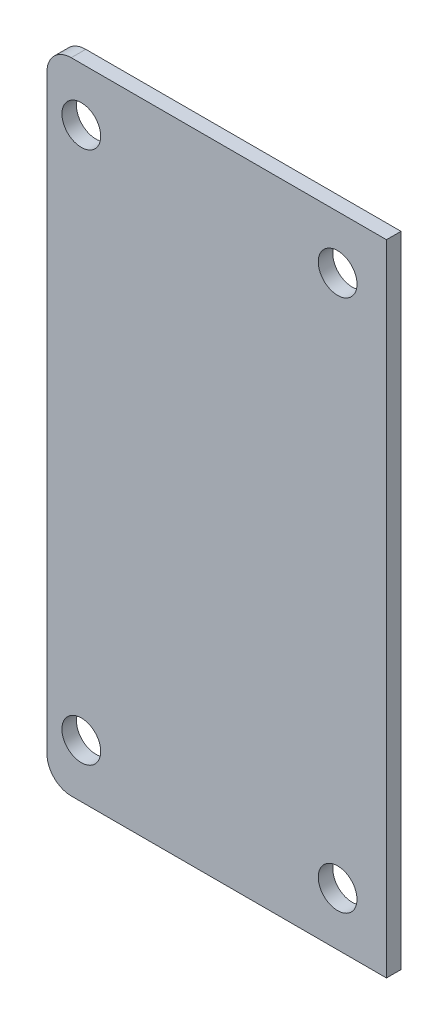
ISO-10303-21;
HEADER;
FILE_DESCRIPTION(('STEP AP214'),'2;1');
FILE_NAME('part.step','',(''),(''),'','','');
FILE_SCHEMA(('AUTOMOTIVE_DESIGN { 1 0 10303 214 1 1 1 1 }'));
ENDSEC;
DATA;
#1=APPLICATION_CONTEXT('core data for automotive mechanical design processes');
#2=APPLICATION_PROTOCOL_DEFINITION('international standard','automotive_design',2000,#1);
#3=PRODUCT_CONTEXT('',#1,'mechanical');
#4=PRODUCT('Part','Part','',(#3));
#5=PRODUCT_RELATED_PRODUCT_CATEGORY('part','',(#4));
#6=PRODUCT_DEFINITION_FORMATION('','',#4);
#7=PRODUCT_DEFINITION_CONTEXT('part definition',#1,'design');
#8=PRODUCT_DEFINITION('design','',#6,#7);
#9=PRODUCT_DEFINITION_SHAPE('','',#8);
#10=(LENGTH_UNIT() NAMED_UNIT(*) SI_UNIT(.MILLI.,.METRE.));
#11=(NAMED_UNIT(*) PLANE_ANGLE_UNIT() SI_UNIT($,.RADIAN.));
#12=(NAMED_UNIT(*) SI_UNIT($,.STERADIAN.) SOLID_ANGLE_UNIT());
#13=UNCERTAINTY_MEASURE_WITH_UNIT(LENGTH_MEASURE(1.E-05),#10,'distance_accuracy_value','');
#14=(GEOMETRIC_REPRESENTATION_CONTEXT(3) GLOBAL_UNCERTAINTY_ASSIGNED_CONTEXT((#13)) GLOBAL_UNIT_ASSIGNED_CONTEXT((#10,
#11,#12)) REPRESENTATION_CONTEXT('',''));
#15=CARTESIAN_POINT('',(0.,0.,0.));
#16=DIRECTION('',(0.,0.,1.));
#17=DIRECTION('',(1.,0.,0.));
#18=AXIS2_PLACEMENT_3D('',#15,#16,#17);
#19=CARTESIAN_POINT('',(-30.042,61.,3.));
#20=DIRECTION('',(0.,0.,1.));
#21=DIRECTION('',(1.,0.,0.));
#22=AXIS2_PLACEMENT_3D('',#19,#20,#21);
#23=PLANE('',#22);
#24=CARTESIAN_POINT('',(-27.958,-55.,3.));
#25=DIRECTION('',(0.,0.,1.));
#26=DIRECTION('',(1.,0.,0.));
#27=AXIS2_PLACEMENT_3D('',#24,#25,#26);
#28=CIRCLE('',#27,4.00000000000001);
#29=CARTESIAN_POINT('',(-23.958,-55.,3.));
#30=VERTEX_POINT('',#29);
#31=EDGE_CURVE('E189',#30,#30,#28,.T.);
#32=ORIENTED_EDGE('',*,*,#31,.F.);
#33=EDGE_LOOP('',(#32));
#34=FACE_BOUND('',#33,.T.);
#35=CARTESIAN_POINT('',(24.958,55.,3.));
#36=DIRECTION('',(0.,0.,1.));
#37=DIRECTION('',(1.,0.,0.));
#38=AXIS2_PLACEMENT_3D('',#35,#36,#37);
#39=CIRCLE('',#38,4.00000000000001);
#40=CARTESIAN_POINT('',(28.958,55.,3.));
#41=VERTEX_POINT('',#40);
#42=EDGE_CURVE('E122',#41,#41,#39,.T.);
#43=ORIENTED_EDGE('',*,*,#42,.F.);
#44=EDGE_LOOP('',(#43));
#45=FACE_BOUND('',#44,.T.);
#46=CARTESIAN_POINT('',(-30.042,61.,3.));
#47=DIRECTION('',(0.,0.,1.));
#48=DIRECTION('',(1.,0.,0.));
#49=AXIS2_PLACEMENT_3D('',#46,#47,#48);
#50=CIRCLE('',#49,5.);
#51=CARTESIAN_POINT('',(-30.042,66.,3.));
#52=VERTEX_POINT('',#51);
#53=CARTESIAN_POINT('',(-35.042,61.,3.));
#54=VERTEX_POINT('',#53);
#55=EDGE_CURVE('E129',#52,#54,#50,.T.);
#56=ORIENTED_EDGE('',*,*,#55,.T.);
#57=DIRECTION('',(0.,-1.,0.));
#58=VECTOR('',#57,1.);
#59=CARTESIAN_POINT('',(-35.042,61.,3.));
#60=LINE('',#59,#58);
#61=CARTESIAN_POINT('',(-35.042,-61.,3.));
#62=VERTEX_POINT('',#61);
#63=EDGE_CURVE('E87',#54,#62,#60,.T.);
#64=ORIENTED_EDGE('',*,*,#63,.T.);
#65=CARTESIAN_POINT('',(-30.042,-61.,3.));
#66=DIRECTION('',(0.,0.,1.));
#67=DIRECTION('',(1.,0.,0.));
#68=AXIS2_PLACEMENT_3D('',#65,#66,#67);
#69=CIRCLE('',#68,5.);
#70=CARTESIAN_POINT('',(-30.042,-66.,3.));
#71=VERTEX_POINT('',#70);
#72=EDGE_CURVE('E100',#62,#71,#69,.T.);
#73=ORIENTED_EDGE('',*,*,#72,.T.);
#74=DIRECTION('',(1.,0.,0.));
#75=VECTOR('',#74,1.);
#76=CARTESIAN_POINT('',(-30.042,-66.,3.));
#77=LINE('',#76,#75);
#78=CARTESIAN_POINT('',(35.042,-66.,3.));
#79=VERTEX_POINT('',#78);
#80=EDGE_CURVE('E94',#71,#79,#77,.T.);
#81=ORIENTED_EDGE('',*,*,#80,.T.);
#82=DIRECTION('',(0.,1.,0.));
#83=VECTOR('',#82,1.);
#84=CARTESIAN_POINT('',(35.042,-66.,3.));
#85=LINE('',#84,#83);
#86=CARTESIAN_POINT('',(35.042,66.,3.));
#87=VERTEX_POINT('',#86);
#88=EDGE_CURVE('E98',#79,#87,#85,.T.);
#89=ORIENTED_EDGE('',*,*,#88,.T.);
#90=DIRECTION('',(-1.,0.,0.));
#91=VECTOR('',#90,1.);
#92=CARTESIAN_POINT('',(35.042,66.,3.));
#93=LINE('',#92,#91);
#94=EDGE_CURVE('E50',#87,#52,#93,.T.);
#95=ORIENTED_EDGE('',*,*,#94,.T.);
#96=EDGE_LOOP('',(#56,#64,#73,#81,#89,#95));
#97=FACE_BOUND('',#96,.T.);
#98=CARTESIAN_POINT('',(-27.958,55.,3.));
#99=DIRECTION('',(0.,0.,1.));
#100=DIRECTION('',(1.,0.,0.));
#101=AXIS2_PLACEMENT_3D('',#98,#99,#100);
#102=CIRCLE('',#101,4.00000000000001);
#103=CARTESIAN_POINT('',(-23.958,55.,3.));
#104=VERTEX_POINT('',#103);
#105=EDGE_CURVE('E195',#104,#104,#102,.T.);
#106=ORIENTED_EDGE('',*,*,#105,.F.);
#107=EDGE_LOOP('',(#106));
#108=FACE_BOUND('',#107,.T.);
#109=CARTESIAN_POINT('',(24.958,-55.,3.));
#110=DIRECTION('',(0.,0.,1.));
#111=DIRECTION('',(1.,0.,0.));
#112=AXIS2_PLACEMENT_3D('',#109,#110,#111);
#113=CIRCLE('',#112,4.00000000000001);
#114=CARTESIAN_POINT('',(28.958,-55.,3.));
#115=VERTEX_POINT('',#114);
#116=EDGE_CURVE('E180',#115,#115,#113,.T.);
#117=ORIENTED_EDGE('',*,*,#116,.F.);
#118=EDGE_LOOP('',(#117));
#119=FACE_BOUND('',#118,.T.);
#120=ADVANCED_FACE('F33',(#34,#45,#97,#108,#119),#23,.T.);
#121=CARTESIAN_POINT('',(-30.042,61.,0.));
#122=DIRECTION('',(0.,0.,1.));
#123=DIRECTION('',(1.,0.,0.));
#124=AXIS2_PLACEMENT_3D('',#121,#122,#123);
#125=PLANE('',#124);
#126=CARTESIAN_POINT('',(-30.042,61.,0.));
#127=DIRECTION('',(0.,0.,1.));
#128=DIRECTION('',(1.,0.,0.));
#129=AXIS2_PLACEMENT_3D('',#126,#127,#128);
#130=CIRCLE('',#129,5.);
#131=CARTESIAN_POINT('',(-30.042,66.,0.));
#132=VERTEX_POINT('',#131);
#133=CARTESIAN_POINT('',(-35.042,61.,0.));
#134=VERTEX_POINT('',#133);
#135=EDGE_CURVE('E118',#132,#134,#130,.T.);
#136=ORIENTED_EDGE('',*,*,#135,.F.);
#137=DIRECTION('',(-1.,0.,0.));
#138=VECTOR('',#137,1.);
#139=CARTESIAN_POINT('',(35.042,66.,0.));
#140=LINE('',#139,#138);
#141=CARTESIAN_POINT('',(35.042,66.,0.));
#142=VERTEX_POINT('',#141);
#143=EDGE_CURVE('E79',#142,#132,#140,.T.);
#144=ORIENTED_EDGE('',*,*,#143,.F.);
#145=DIRECTION('',(0.,1.,0.));
#146=VECTOR('',#145,1.);
#147=CARTESIAN_POINT('',(35.042,-66.,0.));
#148=LINE('',#147,#146);
#149=CARTESIAN_POINT('',(35.042,-66.,0.));
#150=VERTEX_POINT('',#149);
#151=EDGE_CURVE('E73',#150,#142,#148,.T.);
#152=ORIENTED_EDGE('',*,*,#151,.F.);
#153=DIRECTION('',(1.,0.,0.));
#154=VECTOR('',#153,1.);
#155=CARTESIAN_POINT('',(-30.042,-66.,0.));
#156=LINE('',#155,#154);
#157=CARTESIAN_POINT('',(-30.042,-66.,0.));
#158=VERTEX_POINT('',#157);
#159=EDGE_CURVE('E108',#158,#150,#156,.T.);
#160=ORIENTED_EDGE('',*,*,#159,.F.);
#161=CARTESIAN_POINT('',(-30.042,-61.,0.));
#162=DIRECTION('',(0.,0.,1.));
#163=DIRECTION('',(1.,0.,0.));
#164=AXIS2_PLACEMENT_3D('',#161,#162,#163);
#165=CIRCLE('',#164,5.);
#166=CARTESIAN_POINT('',(-35.042,-61.,0.));
#167=VERTEX_POINT('',#166);
#168=EDGE_CURVE('E124',#167,#158,#165,.T.);
#169=ORIENTED_EDGE('',*,*,#168,.F.);
#170=DIRECTION('',(0.,-1.,0.));
#171=VECTOR('',#170,1.);
#172=CARTESIAN_POINT('',(-35.042,61.,0.));
#173=LINE('',#172,#171);
#174=EDGE_CURVE('E121',#134,#167,#173,.T.);
#175=ORIENTED_EDGE('',*,*,#174,.F.);
#176=EDGE_LOOP('',(#136,#144,#152,#160,#169,#175));
#177=FACE_BOUND('',#176,.T.);
#178=CARTESIAN_POINT('',(24.958,55.,0.));
#179=DIRECTION('',(0.,0.,1.));
#180=DIRECTION('',(1.,0.,0.));
#181=AXIS2_PLACEMENT_3D('',#178,#179,#180);
#182=CIRCLE('',#181,4.00000000000001);
#183=CARTESIAN_POINT('',(28.958,55.,0.));
#184=VERTEX_POINT('',#183);
#185=EDGE_CURVE('E198',#184,#184,#182,.T.);
#186=ORIENTED_EDGE('',*,*,#185,.T.);
#187=EDGE_LOOP('',(#186));
#188=FACE_BOUND('',#187,.T.);
#189=CARTESIAN_POINT('',(-27.958,55.,0.));
#190=DIRECTION('',(0.,0.,1.));
#191=DIRECTION('',(1.,0.,0.));
#192=AXIS2_PLACEMENT_3D('',#189,#190,#191);
#193=CIRCLE('',#192,4.00000000000001);
#194=CARTESIAN_POINT('',(-23.958,55.,0.));
#195=VERTEX_POINT('',#194);
#196=EDGE_CURVE('E192',#195,#195,#193,.T.);
#197=ORIENTED_EDGE('',*,*,#196,.T.);
#198=EDGE_LOOP('',(#197));
#199=FACE_BOUND('',#198,.T.);
#200=CARTESIAN_POINT('',(-27.958,-55.,0.));
#201=DIRECTION('',(0.,0.,1.));
#202=DIRECTION('',(1.,0.,0.));
#203=AXIS2_PLACEMENT_3D('',#200,#201,#202);
#204=CIRCLE('',#203,4.00000000000001);
#205=CARTESIAN_POINT('',(-23.958,-55.,0.));
#206=VERTEX_POINT('',#205);
#207=EDGE_CURVE('E186',#206,#206,#204,.T.);
#208=ORIENTED_EDGE('',*,*,#207,.T.);
#209=EDGE_LOOP('',(#208));
#210=FACE_BOUND('',#209,.T.);
#211=CARTESIAN_POINT('',(24.958,-55.,0.));
#212=DIRECTION('',(0.,0.,1.));
#213=DIRECTION('',(1.,0.,0.));
#214=AXIS2_PLACEMENT_3D('',#211,#212,#213);
#215=CIRCLE('',#214,4.00000000000001);
#216=CARTESIAN_POINT('',(28.958,-55.,0.));
#217=VERTEX_POINT('',#216);
#218=EDGE_CURVE('E183',#217,#217,#215,.T.);
#219=ORIENTED_EDGE('',*,*,#218,.T.);
#220=EDGE_LOOP('',(#219));
#221=FACE_BOUND('',#220,.T.);
#222=ADVANCED_FACE('F138',(#177,#188,#199,#210,#221),#125,.F.);
#223=CARTESIAN_POINT('',(-30.042,61.,3.));
#224=DIRECTION('',(0.,0.,-1.));
#225=DIRECTION('',(-1.,0.,0.));
#226=AXIS2_PLACEMENT_3D('',#223,#224,#225);
#227=CYLINDRICAL_SURFACE('',#226,5.);
#228=ORIENTED_EDGE('',*,*,#135,.T.);
#229=DIRECTION('',(0.,0.,-1.));
#230=VECTOR('',#229,1.);
#231=CARTESIAN_POINT('',(-35.042,61.,3.));
#232=LINE('',#231,#230);
#233=EDGE_CURVE('E11',#54,#134,#232,.T.);
#234=ORIENTED_EDGE('',*,*,#233,.F.);
#235=ORIENTED_EDGE('',*,*,#55,.F.);
#236=DIRECTION('',(0.,0.,-1.));
#237=VECTOR('',#236,1.);
#238=CARTESIAN_POINT('',(-30.042,66.,3.));
#239=LINE('',#238,#237);
#240=EDGE_CURVE('E114',#52,#132,#239,.T.);
#241=ORIENTED_EDGE('',*,*,#240,.T.);
#242=EDGE_LOOP('',(#228,#234,#235,#241));
#243=FACE_BOUND('',#242,.T.);
#244=ADVANCED_FACE('F35',(#243),#227,.T.);
#245=CARTESIAN_POINT('',(-35.042,61.,3.));
#246=DIRECTION('',(1.,0.,0.));
#247=DIRECTION('',(0.,0.,-1.));
#248=AXIS2_PLACEMENT_3D('',#245,#246,#247);
#249=PLANE('',#248);
#250=ORIENTED_EDGE('',*,*,#174,.T.);
#251=DIRECTION('',(0.,0.,-1.));
#252=VECTOR('',#251,1.);
#253=CARTESIAN_POINT('',(-35.042,-61.,3.));
#254=LINE('',#253,#252);
#255=EDGE_CURVE('E42',#62,#167,#254,.T.);
#256=ORIENTED_EDGE('',*,*,#255,.F.);
#257=ORIENTED_EDGE('',*,*,#63,.F.);
#258=ORIENTED_EDGE('',*,*,#233,.T.);
#259=EDGE_LOOP('',(#250,#256,#257,#258));
#260=FACE_BOUND('',#259,.T.);
#261=ADVANCED_FACE('F256',(#260),#249,.F.);
#262=CARTESIAN_POINT('',(-30.042,-61.,3.));
#263=DIRECTION('',(0.,0.,-1.));
#264=DIRECTION('',(-1.,0.,0.));
#265=AXIS2_PLACEMENT_3D('',#262,#263,#264);
#266=CYLINDRICAL_SURFACE('',#265,5.);
#267=ORIENTED_EDGE('',*,*,#168,.T.);
#268=DIRECTION('',(0.,0.,-1.));
#269=VECTOR('',#268,1.);
#270=CARTESIAN_POINT('',(-30.042,-66.,3.));
#271=LINE('',#270,#269);
#272=EDGE_CURVE('E109',#71,#158,#271,.T.);
#273=ORIENTED_EDGE('',*,*,#272,.F.);
#274=ORIENTED_EDGE('',*,*,#72,.F.);
#275=ORIENTED_EDGE('',*,*,#255,.T.);
#276=EDGE_LOOP('',(#267,#273,#274,#275));
#277=FACE_BOUND('',#276,.T.);
#278=ADVANCED_FACE('F135',(#277),#266,.T.);
#279=CARTESIAN_POINT('',(-30.042,-66.,3.));
#280=DIRECTION('',(0.,1.,0.));
#281=DIRECTION('',(0.,0.,1.));
#282=AXIS2_PLACEMENT_3D('',#279,#280,#281);
#283=PLANE('',#282);
#284=ORIENTED_EDGE('',*,*,#159,.T.);
#285=DIRECTION('',(0.,0.,-1.));
#286=VECTOR('',#285,1.);
#287=CARTESIAN_POINT('',(35.042,-66.,3.));
#288=LINE('',#287,#286);
#289=EDGE_CURVE('E105',#79,#150,#288,.T.);
#290=ORIENTED_EDGE('',*,*,#289,.F.);
#291=ORIENTED_EDGE('',*,*,#80,.F.);
#292=ORIENTED_EDGE('',*,*,#272,.T.);
#293=EDGE_LOOP('',(#284,#290,#291,#292));
#294=FACE_BOUND('',#293,.T.);
#295=ADVANCED_FACE('F106',(#294),#283,.F.);
#296=CARTESIAN_POINT('',(35.042,-66.,3.));
#297=DIRECTION('',(-1.,0.,0.));
#298=DIRECTION('',(0.,0.,1.));
#299=AXIS2_PLACEMENT_3D('',#296,#297,#298);
#300=PLANE('',#299);
#301=ORIENTED_EDGE('',*,*,#151,.T.);
#302=DIRECTION('',(0.,0.,-1.));
#303=VECTOR('',#302,1.);
#304=CARTESIAN_POINT('',(35.042,66.,3.));
#305=LINE('',#304,#303);
#306=EDGE_CURVE('E110',#87,#142,#305,.T.);
#307=ORIENTED_EDGE('',*,*,#306,.F.);
#308=ORIENTED_EDGE('',*,*,#88,.F.);
#309=ORIENTED_EDGE('',*,*,#289,.T.);
#310=EDGE_LOOP('',(#301,#307,#308,#309));
#311=FACE_BOUND('',#310,.T.);
#312=ADVANCED_FACE('F112',(#311),#300,.F.);
#313=CARTESIAN_POINT('',(35.042,66.,3.));
#314=DIRECTION('',(0.,-1.,0.));
#315=DIRECTION('',(0.,0.,-1.));
#316=AXIS2_PLACEMENT_3D('',#313,#314,#315);
#317=PLANE('',#316);
#318=ORIENTED_EDGE('',*,*,#143,.T.);
#319=ORIENTED_EDGE('',*,*,#240,.F.);
#320=ORIENTED_EDGE('',*,*,#94,.F.);
#321=ORIENTED_EDGE('',*,*,#306,.T.);
#322=EDGE_LOOP('',(#318,#319,#320,#321));
#323=FACE_BOUND('',#322,.T.);
#324=ADVANCED_FACE('F143',(#323),#317,.F.);
#325=CARTESIAN_POINT('',(24.958,55.,3.));
#326=DIRECTION('',(0.,0.,-1.));
#327=DIRECTION('',(-1.,0.,0.));
#328=AXIS2_PLACEMENT_3D('',#325,#326,#327);
#329=CYLINDRICAL_SURFACE('',#328,4.00000000000001);
#330=ORIENTED_EDGE('',*,*,#42,.T.);
#331=EDGE_LOOP('',(#330));
#332=FACE_BOUND('',#331,.T.);
#333=ORIENTED_EDGE('',*,*,#185,.F.);
#334=EDGE_LOOP('',(#333));
#335=FACE_BOUND('',#334,.T.);
#336=ADVANCED_FACE('F145',(#332,#335),#329,.F.);
#337=CARTESIAN_POINT('',(-27.958,55.,3.));
#338=DIRECTION('',(0.,0.,-1.));
#339=DIRECTION('',(-1.,0.,0.));
#340=AXIS2_PLACEMENT_3D('',#337,#338,#339);
#341=CYLINDRICAL_SURFACE('',#340,4.00000000000001);
#342=ORIENTED_EDGE('',*,*,#105,.T.);
#343=EDGE_LOOP('',(#342));
#344=FACE_BOUND('',#343,.T.);
#345=ORIENTED_EDGE('',*,*,#196,.F.);
#346=EDGE_LOOP('',(#345));
#347=FACE_BOUND('',#346,.T.);
#348=ADVANCED_FACE('F151',(#344,#347),#341,.F.);
#349=CARTESIAN_POINT('',(-27.958,-55.,3.));
#350=DIRECTION('',(0.,0.,-1.));
#351=DIRECTION('',(-1.,0.,0.));
#352=AXIS2_PLACEMENT_3D('',#349,#350,#351);
#353=CYLINDRICAL_SURFACE('',#352,4.00000000000001);
#354=ORIENTED_EDGE('',*,*,#31,.T.);
#355=EDGE_LOOP('',(#354));
#356=FACE_BOUND('',#355,.T.);
#357=ORIENTED_EDGE('',*,*,#207,.F.);
#358=EDGE_LOOP('',(#357));
#359=FACE_BOUND('',#358,.T.);
#360=ADVANCED_FACE('F167',(#356,#359),#353,.F.);
#361=CARTESIAN_POINT('',(24.958,-55.,3.));
#362=DIRECTION('',(0.,0.,-1.));
#363=DIRECTION('',(-1.,0.,0.));
#364=AXIS2_PLACEMENT_3D('',#361,#362,#363);
#365=CYLINDRICAL_SURFACE('',#364,4.00000000000001);
#366=ORIENTED_EDGE('',*,*,#116,.T.);
#367=EDGE_LOOP('',(#366));
#368=FACE_BOUND('',#367,.T.);
#369=ORIENTED_EDGE('',*,*,#218,.F.);
#370=EDGE_LOOP('',(#369));
#371=FACE_BOUND('',#370,.T.);
#372=ADVANCED_FACE('F171',(#368,#371),#365,.F.);
#373=CLOSED_SHELL('',(#120,#222,#244,#261,#278,#295,#312,#324,#336,#348,#360,#372));
#374=MANIFOLD_SOLID_BREP('B2',#373);
#375=ADVANCED_BREP_SHAPE_REPRESENTATION('',(#18,#374),#14);
#376=SHAPE_DEFINITION_REPRESENTATION(#9,#375);
ENDSEC;
END-ISO-10303-21;
